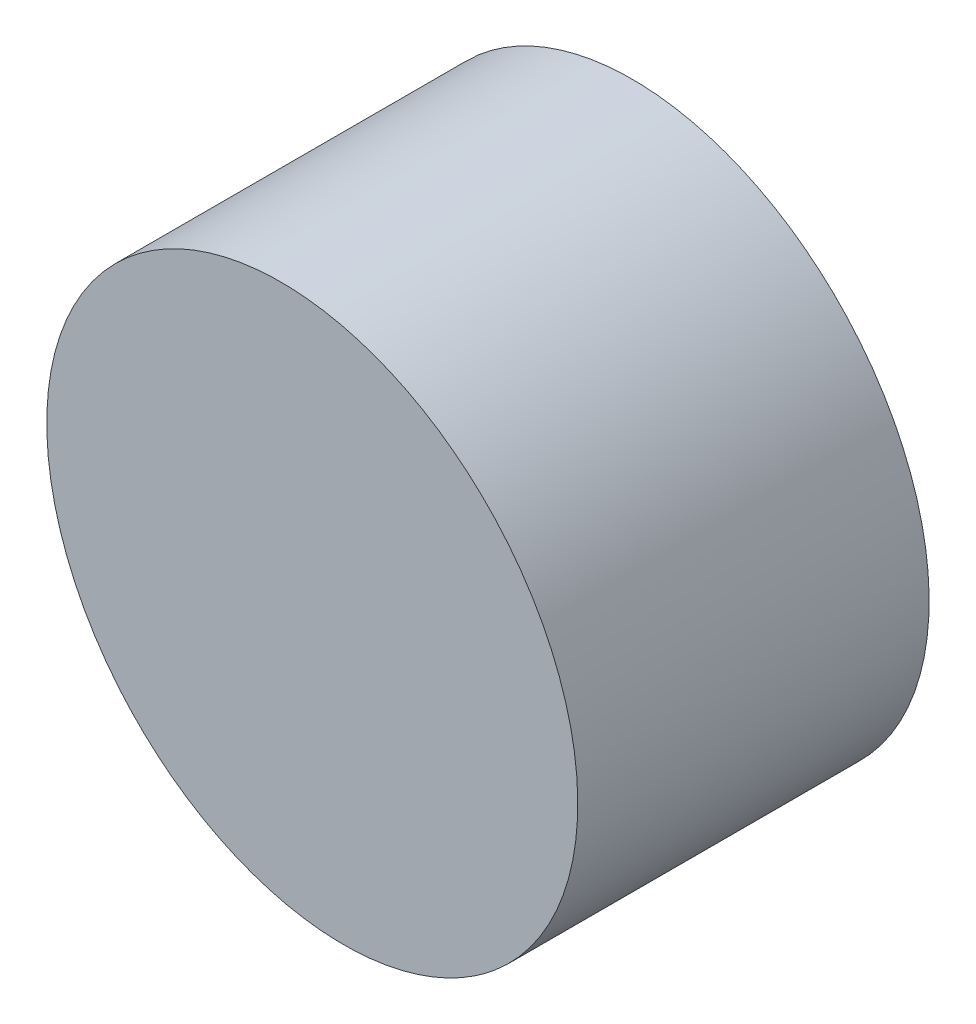
ISO-10303-21;
HEADER;
FILE_DESCRIPTION(('STEP AP214'),'2;1');
FILE_NAME('part.step','',(''),(''),'','','');
FILE_SCHEMA(('AUTOMOTIVE_DESIGN { 1 0 10303 214 1 1 1 1 }'));
ENDSEC;
DATA;
#1=APPLICATION_CONTEXT('core data for automotive mechanical design processes');
#2=APPLICATION_PROTOCOL_DEFINITION('international standard','automotive_design',2000,#1);
#3=PRODUCT_CONTEXT('',#1,'mechanical');
#4=PRODUCT('Part','Part','',(#3));
#5=PRODUCT_RELATED_PRODUCT_CATEGORY('part','',(#4));
#6=PRODUCT_DEFINITION_FORMATION('','',#4);
#7=PRODUCT_DEFINITION_CONTEXT('part definition',#1,'design');
#8=PRODUCT_DEFINITION('design','',#6,#7);
#9=PRODUCT_DEFINITION_SHAPE('','',#8);
#10=(LENGTH_UNIT() NAMED_UNIT(*) SI_UNIT(.MILLI.,.METRE.));
#11=(NAMED_UNIT(*) PLANE_ANGLE_UNIT() SI_UNIT($,.RADIAN.));
#12=(NAMED_UNIT(*) SI_UNIT($,.STERADIAN.) SOLID_ANGLE_UNIT());
#13=UNCERTAINTY_MEASURE_WITH_UNIT(LENGTH_MEASURE(1.E-05),#10,'distance_accuracy_value','');
#14=(GEOMETRIC_REPRESENTATION_CONTEXT(3) GLOBAL_UNCERTAINTY_ASSIGNED_CONTEXT((#13)) GLOBAL_UNIT_ASSIGNED_CONTEXT((#10,
#11,#12)) REPRESENTATION_CONTEXT('',''));
#15=CARTESIAN_POINT('',(0.,0.,0.));
#16=DIRECTION('',(0.,0.,1.));
#17=DIRECTION('',(1.,0.,0.));
#18=AXIS2_PLACEMENT_3D('',#15,#16,#17);
#19=CARTESIAN_POINT('',(0.,0.,38.1));
#20=DIRECTION('',(0.,0.,1.));
#21=DIRECTION('',(0.640615883558486,-0.767861504265307,0.));
#22=AXIS2_PLACEMENT_3D('',#19,#20,#21);
#23=ELLIPSE('',#22,30.8068748593918,27.3033572183293);
#24=DIRECTION('',(0.,0.,-1.));
#25=VECTOR('',#24,1.);
#26=SURFACE_OF_LINEAR_EXTRUSION('',#23,#25);
#27=CARTESIAN_POINT('',(19.735373357725,-23.6554132712456,38.1));
#28=VERTEX_POINT('',#27);
#29=EDGE_CURVE('E10',#28,#28,#23,.T.);
#30=ORIENTED_EDGE('',*,*,#29,.F.);
#31=EDGE_LOOP('',(#30));
#32=FACE_BOUND('',#31,.T.);
#33=CARTESIAN_POINT('',(0.,0.,0.));
#34=DIRECTION('',(0.,0.,1.));
#35=DIRECTION('',(0.640615883558486,-0.767861504265307,0.));
#36=AXIS2_PLACEMENT_3D('',#33,#34,#35);
#37=ELLIPSE('',#36,30.8068748593918,27.3033572183293);
#38=CARTESIAN_POINT('',(19.735373357725,-23.6554132712456,0.));
#39=VERTEX_POINT('',#38);
#40=EDGE_CURVE('E35',#39,#39,#37,.T.);
#41=ORIENTED_EDGE('',*,*,#40,.T.);
#42=EDGE_LOOP('',(#41));
#43=FACE_BOUND('',#42,.T.);
#44=ADVANCED_FACE('F31',(#32,#43),#26,.F.);
#45=CARTESIAN_POINT('',(0.,0.,38.1));
#46=DIRECTION('',(0.,0.,1.));
#47=DIRECTION('',(1.,0.,0.));
#48=AXIS2_PLACEMENT_3D('',#45,#46,#47);
#49=PLANE('',#48);
#50=ORIENTED_EDGE('',*,*,#29,.T.);
#51=EDGE_LOOP('',(#50));
#52=FACE_BOUND('',#51,.T.);
#53=ADVANCED_FACE('F47',(#52),#49,.T.);
#54=CARTESIAN_POINT('',(0.,0.,0.));
#55=DIRECTION('',(0.,0.,1.));
#56=DIRECTION('',(1.,0.,0.));
#57=AXIS2_PLACEMENT_3D('',#54,#55,#56);
#58=PLANE('',#57);
#59=ORIENTED_EDGE('',*,*,#40,.F.);
#60=EDGE_LOOP('',(#59));
#61=FACE_BOUND('',#60,.T.);
#62=ADVANCED_FACE('F45',(#61),#58,.F.);
#63=CLOSED_SHELL('',(#44,#53,#62));
#64=MANIFOLD_SOLID_BREP('B2',#63);
#65=ADVANCED_BREP_SHAPE_REPRESENTATION('',(#18,#64),#14);
#66=SHAPE_DEFINITION_REPRESENTATION(#9,#65);
ENDSEC;
END-ISO-10303-21;
